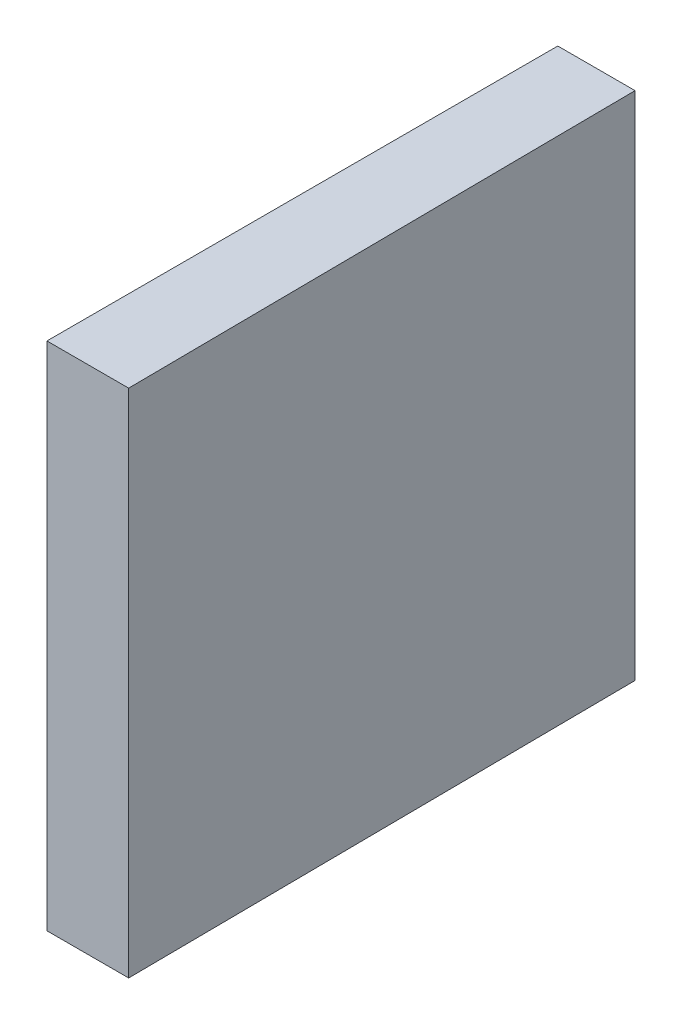
ISO-10303-21;
HEADER;
FILE_DESCRIPTION(('STEP AP214'),'2;1');
FILE_NAME('part.step','',(''),(''),'','','');
FILE_SCHEMA(('AUTOMOTIVE_DESIGN { 1 0 10303 214 1 1 1 1 }'));
ENDSEC;
DATA;
#1=APPLICATION_CONTEXT('core data for automotive mechanical design processes');
#2=APPLICATION_PROTOCOL_DEFINITION('international standard','automotive_design',2000,#1);
#3=PRODUCT_CONTEXT('',#1,'mechanical');
#4=PRODUCT('Part','Part','',(#3));
#5=PRODUCT_RELATED_PRODUCT_CATEGORY('part','',(#4));
#6=PRODUCT_DEFINITION_FORMATION('','',#4);
#7=PRODUCT_DEFINITION_CONTEXT('part definition',#1,'design');
#8=PRODUCT_DEFINITION('design','',#6,#7);
#9=PRODUCT_DEFINITION_SHAPE('','',#8);
#10=(LENGTH_UNIT() NAMED_UNIT(*) SI_UNIT(.MILLI.,.METRE.));
#11=(NAMED_UNIT(*) PLANE_ANGLE_UNIT() SI_UNIT($,.RADIAN.));
#12=(NAMED_UNIT(*) SI_UNIT($,.STERADIAN.) SOLID_ANGLE_UNIT());
#13=UNCERTAINTY_MEASURE_WITH_UNIT(LENGTH_MEASURE(1.E-05),#10,'distance_accuracy_value','');
#14=(GEOMETRIC_REPRESENTATION_CONTEXT(3) GLOBAL_UNCERTAINTY_ASSIGNED_CONTEXT((#13)) GLOBAL_UNIT_ASSIGNED_CONTEXT((#10,
#11,#12)) REPRESENTATION_CONTEXT('',''));
#15=CARTESIAN_POINT('',(0.,0.,0.));
#16=DIRECTION('',(0.,0.,1.));
#17=DIRECTION('',(1.,0.,0.));
#18=AXIS2_PLACEMENT_3D('',#15,#16,#17);
#19=CARTESIAN_POINT('',(0.,50.,-25.));
#20=DIRECTION('',(0.,0.,1.));
#21=DIRECTION('',(1.,0.,0.));
#22=AXIS2_PLACEMENT_3D('',#19,#20,#21);
#23=PLANE('',#22);
#24=DIRECTION('',(-1.,0.,0.));
#25=VECTOR('',#24,1.);
#26=CARTESIAN_POINT('',(0.,0.,-25.));
#27=LINE('',#26,#25);
#28=CARTESIAN_POINT('',(7.56365661046241,0.,-25.));
#29=VERTEX_POINT('',#28);
#30=CARTESIAN_POINT('',(0.,0.,-25.));
#31=VERTEX_POINT('',#30);
#32=EDGE_CURVE('E96',#29,#31,#27,.T.);
#33=ORIENTED_EDGE('',*,*,#32,.T.);
#34=DIRECTION('',(0.,-1.,0.));
#35=VECTOR('',#34,1.);
#36=CARTESIAN_POINT('',(0.,50.,-25.));
#37=LINE('',#36,#35);
#38=CARTESIAN_POINT('',(0.,50.,-25.));
#39=VERTEX_POINT('',#38);
#40=EDGE_CURVE('E11',#39,#31,#37,.T.);
#41=ORIENTED_EDGE('',*,*,#40,.F.);
#42=DIRECTION('',(-1.,0.,0.));
#43=VECTOR('',#42,1.);
#44=CARTESIAN_POINT('',(0.,50.,-25.));
#45=LINE('',#44,#43);
#46=CARTESIAN_POINT('',(7.56365661046241,50.,-25.));
#47=VERTEX_POINT('',#46);
#48=EDGE_CURVE('E84',#47,#39,#45,.T.);
#49=ORIENTED_EDGE('',*,*,#48,.F.);
#50=DIRECTION('',(0.,-1.,0.));
#51=VECTOR('',#50,1.);
#52=CARTESIAN_POINT('',(7.56365661046241,50.,-25.));
#53=LINE('',#52,#51);
#54=EDGE_CURVE('E92',#47,#29,#53,.T.);
#55=ORIENTED_EDGE('',*,*,#54,.T.);
#56=EDGE_LOOP('',(#33,#41,#49,#55));
#57=FACE_BOUND('',#56,.T.);
#58=ADVANCED_FACE('F33',(#57),#23,.F.);
#59=CARTESIAN_POINT('',(0.,50.,-25.));
#60=DIRECTION('',(1.,0.,0.));
#61=DIRECTION('',(0.,0.,-1.));
#62=AXIS2_PLACEMENT_3D('',#59,#60,#61);
#63=PLANE('',#62);
#64=DIRECTION('',(0.,0.,1.));
#65=VECTOR('',#64,1.);
#66=CARTESIAN_POINT('',(0.,0.,-25.));
#67=LINE('',#66,#65);
#68=CARTESIAN_POINT('',(0.,0.,25.));
#69=VERTEX_POINT('',#68);
#70=EDGE_CURVE('E88',#31,#69,#67,.T.);
#71=ORIENTED_EDGE('',*,*,#70,.T.);
#72=DIRECTION('',(0.,-1.,0.));
#73=VECTOR('',#72,1.);
#74=CARTESIAN_POINT('',(0.,50.,25.));
#75=LINE('',#74,#73);
#76=CARTESIAN_POINT('',(0.,50.,25.));
#77=VERTEX_POINT('',#76);
#78=EDGE_CURVE('E41',#77,#69,#75,.T.);
#79=ORIENTED_EDGE('',*,*,#78,.F.);
#80=DIRECTION('',(0.,0.,1.));
#81=VECTOR('',#80,1.);
#82=CARTESIAN_POINT('',(0.,50.,-25.));
#83=LINE('',#82,#81);
#84=EDGE_CURVE('E79',#39,#77,#83,.T.);
#85=ORIENTED_EDGE('',*,*,#84,.F.);
#86=ORIENTED_EDGE('',*,*,#40,.T.);
#87=EDGE_LOOP('',(#71,#79,#85,#86));
#88=FACE_BOUND('',#87,.T.);
#89=ADVANCED_FACE('F87',(#88),#63,.F.);
#90=CARTESIAN_POINT('',(0.,50.,25.));
#91=DIRECTION('',(0.,0.,-1.));
#92=DIRECTION('',(-1.,0.,0.));
#93=AXIS2_PLACEMENT_3D('',#90,#91,#92);
#94=PLANE('',#93);
#95=DIRECTION('',(1.,0.,0.));
#96=VECTOR('',#95,1.);
#97=CARTESIAN_POINT('',(0.,0.,25.));
#98=LINE('',#97,#96);
#99=CARTESIAN_POINT('',(8.00000000000001,0.,25.));
#100=VERTEX_POINT('',#99);
#101=EDGE_CURVE('E66',#69,#100,#98,.T.);
#102=ORIENTED_EDGE('',*,*,#101,.T.);
#103=DIRECTION('',(0.,-1.,0.));
#104=VECTOR('',#103,1.);
#105=CARTESIAN_POINT('',(8.00000000000001,50.,25.));
#106=LINE('',#105,#104);
#107=CARTESIAN_POINT('',(8.00000000000001,50.,25.));
#108=VERTEX_POINT('',#107);
#109=EDGE_CURVE('E89',#108,#100,#106,.T.);
#110=ORIENTED_EDGE('',*,*,#109,.F.);
#111=DIRECTION('',(1.,0.,0.));
#112=VECTOR('',#111,1.);
#113=CARTESIAN_POINT('',(0.,50.,25.));
#114=LINE('',#113,#112);
#115=EDGE_CURVE('E82',#77,#108,#114,.T.);
#116=ORIENTED_EDGE('',*,*,#115,.F.);
#117=ORIENTED_EDGE('',*,*,#78,.T.);
#118=EDGE_LOOP('',(#102,#110,#116,#117));
#119=FACE_BOUND('',#118,.T.);
#120=ADVANCED_FACE('F90',(#119),#94,.F.);
#121=CARTESIAN_POINT('',(8.00000000000001,50.,25.));
#122=DIRECTION('',(-0.999961923064171,0.,0.00872653549836698));
#123=DIRECTION('',(0.00872653549836698,0.,0.999961923064171));
#124=AXIS2_PLACEMENT_3D('',#121,#122,#123);
#125=PLANE('',#124);
#126=DIRECTION('',(-0.00872653549836698,0.,-0.999961923064171));
#127=VECTOR('',#126,1.);
#128=CARTESIAN_POINT('',(8.00000000000001,0.,25.));
#129=LINE('',#128,#127);
#130=EDGE_CURVE('E72',#100,#29,#129,.T.);
#131=ORIENTED_EDGE('',*,*,#130,.T.);
#132=ORIENTED_EDGE('',*,*,#54,.F.);
#133=DIRECTION('',(-0.00872653549836698,0.,-0.999961923064171));
#134=VECTOR('',#133,1.);
#135=CARTESIAN_POINT('',(8.00000000000001,50.,25.));
#136=LINE('',#135,#134);
#137=EDGE_CURVE('E49',#108,#47,#136,.T.);
#138=ORIENTED_EDGE('',*,*,#137,.F.);
#139=ORIENTED_EDGE('',*,*,#109,.T.);
#140=EDGE_LOOP('',(#131,#132,#138,#139));
#141=FACE_BOUND('',#140,.T.);
#142=ADVANCED_FACE('F103',(#141),#125,.F.);
#143=CARTESIAN_POINT('',(0.,50.,0.));
#144=DIRECTION('',(0.,-1.,0.));
#145=DIRECTION('',(0.,0.,-1.));
#146=AXIS2_PLACEMENT_3D('',#143,#144,#145);
#147=PLANE('',#146);
#148=ORIENTED_EDGE('',*,*,#48,.T.);
#149=ORIENTED_EDGE('',*,*,#84,.T.);
#150=ORIENTED_EDGE('',*,*,#115,.T.);
#151=ORIENTED_EDGE('',*,*,#137,.T.);
#152=EDGE_LOOP('',(#148,#149,#150,#151));
#153=FACE_BOUND('',#152,.T.);
#154=ADVANCED_FACE('F80',(#153),#147,.F.);
#155=CARTESIAN_POINT('',(0.,0.,0.));
#156=DIRECTION('',(0.,-1.,0.));
#157=DIRECTION('',(0.,0.,-1.));
#158=AXIS2_PLACEMENT_3D('',#155,#156,#157);
#159=PLANE('',#158);
#160=ORIENTED_EDGE('',*,*,#32,.F.);
#161=ORIENTED_EDGE('',*,*,#130,.F.);
#162=ORIENTED_EDGE('',*,*,#101,.F.);
#163=ORIENTED_EDGE('',*,*,#70,.F.);
#164=EDGE_LOOP('',(#160,#161,#162,#163));
#165=FACE_BOUND('',#164,.T.);
#166=ADVANCED_FACE('F106',(#165),#159,.T.);
#167=CLOSED_SHELL('',(#58,#89,#120,#142,#154,#166));
#168=MANIFOLD_SOLID_BREP('B2',#167);
#169=ADVANCED_BREP_SHAPE_REPRESENTATION('',(#18,#168),#14);
#170=SHAPE_DEFINITION_REPRESENTATION(#9,#169);
ENDSEC;
END-ISO-10303-21;
